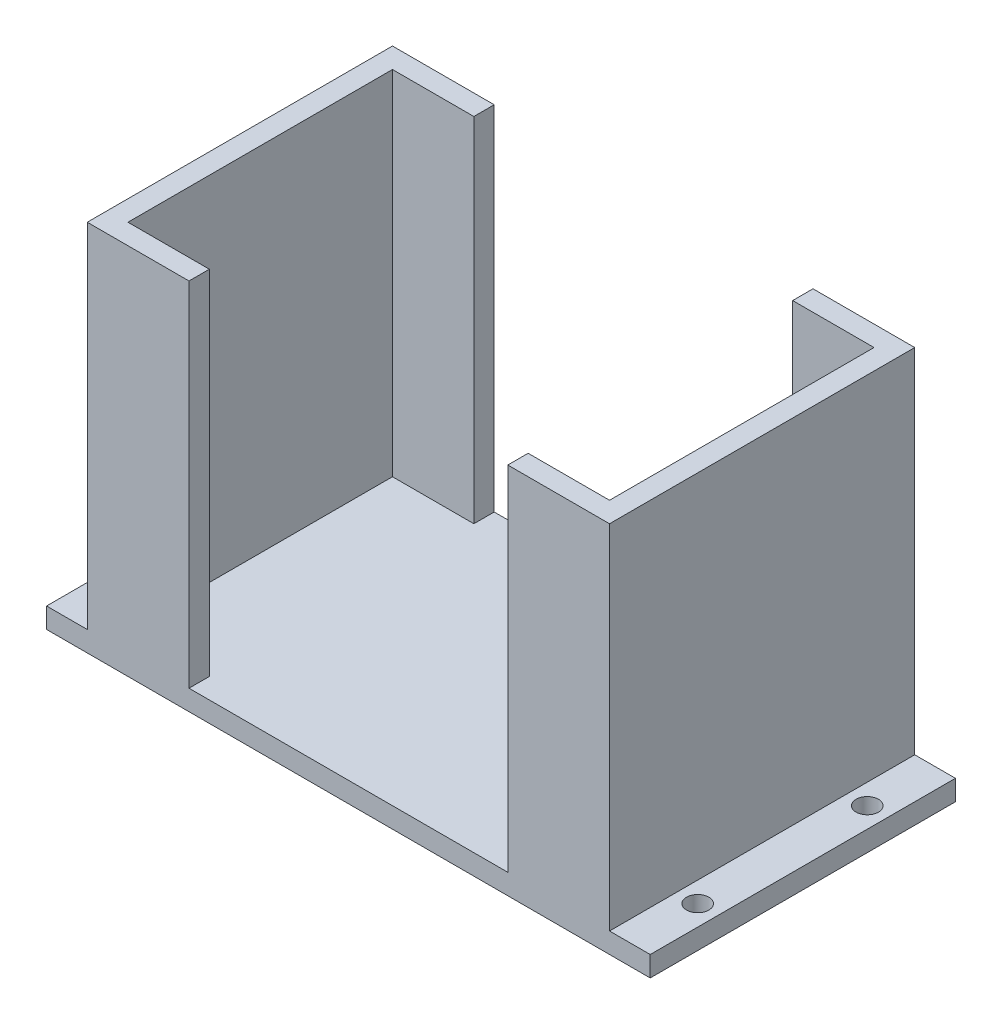
ISO-10303-21;
HEADER;
FILE_DESCRIPTION(('STEP AP214'),'2;1');
FILE_NAME('part.step','',(''),(''),'','','');
FILE_SCHEMA(('AUTOMOTIVE_DESIGN { 1 0 10303 214 1 1 1 1 }'));
ENDSEC;
DATA;
#1=APPLICATION_CONTEXT('core data for automotive mechanical design processes');
#2=APPLICATION_PROTOCOL_DEFINITION('international standard','automotive_design',2000,#1);
#3=PRODUCT_CONTEXT('',#1,'mechanical');
#4=PRODUCT('Part','Part','',(#3));
#5=PRODUCT_RELATED_PRODUCT_CATEGORY('part','',(#4));
#6=PRODUCT_DEFINITION_FORMATION('','',#4);
#7=PRODUCT_DEFINITION_CONTEXT('part definition',#1,'design');
#8=PRODUCT_DEFINITION('design','',#6,#7);
#9=PRODUCT_DEFINITION_SHAPE('','',#8);
#10=(LENGTH_UNIT() NAMED_UNIT(*) SI_UNIT(.MILLI.,.METRE.));
#11=(NAMED_UNIT(*) PLANE_ANGLE_UNIT() SI_UNIT($,.RADIAN.));
#12=(NAMED_UNIT(*) SI_UNIT($,.STERADIAN.) SOLID_ANGLE_UNIT());
#13=UNCERTAINTY_MEASURE_WITH_UNIT(LENGTH_MEASURE(1.E-05),#10,'distance_accuracy_value','');
#14=(GEOMETRIC_REPRESENTATION_CONTEXT(3) GLOBAL_UNCERTAINTY_ASSIGNED_CONTEXT((#13)) GLOBAL_UNIT_ASSIGNED_CONTEXT((#10,
#11,#12)) REPRESENTATION_CONTEXT('',''));
#15=CARTESIAN_POINT('',(0.,0.,0.));
#16=DIRECTION('',(0.,0.,1.));
#17=DIRECTION('',(1.,0.,0.));
#18=AXIS2_PLACEMENT_3D('',#15,#16,#17);
#19=CARTESIAN_POINT('',(-38.5,55.,0.));
#20=DIRECTION('',(1.,0.,0.));
#21=DIRECTION('',(0.,0.,-1.));
#22=AXIS2_PLACEMENT_3D('',#19,#20,#21);
#23=PLANE('',#22);
#24=DIRECTION('',(0.,0.,-1.));
#25=VECTOR('',#24,1.);
#26=CARTESIAN_POINT('',(-38.5,3.,-22.5));
#27=LINE('',#26,#25);
#28=CARTESIAN_POINT('',(-38.5,3.,22.5));
#29=VERTEX_POINT('',#28);
#30=CARTESIAN_POINT('',(-38.5,3.,-22.5));
#31=VERTEX_POINT('',#30);
#32=EDGE_CURVE('E50',#29,#31,#27,.T.);
#33=ORIENTED_EDGE('',*,*,#32,.F.);
#34=DIRECTION('',(0.,-1.,0.));
#35=VECTOR('',#34,1.);
#36=CARTESIAN_POINT('',(-38.5,55.,22.5));
#37=LINE('',#36,#35);
#38=CARTESIAN_POINT('',(-38.5,55.,22.5));
#39=VERTEX_POINT('',#38);
#40=EDGE_CURVE('E11',#39,#29,#37,.T.);
#41=ORIENTED_EDGE('',*,*,#40,.F.);
#42=DIRECTION('',(0.,0.,1.));
#43=VECTOR('',#42,1.);
#44=CARTESIAN_POINT('',(-38.5,55.,0.));
#45=LINE('',#44,#43);
#46=CARTESIAN_POINT('',(-38.5,55.,-22.5));
#47=VERTEX_POINT('',#46);
#48=EDGE_CURVE('E183',#47,#39,#45,.T.);
#49=ORIENTED_EDGE('',*,*,#48,.F.);
#50=DIRECTION('',(0.,-1.,0.));
#51=VECTOR('',#50,1.);
#52=CARTESIAN_POINT('',(-38.5,55.,-22.5));
#53=LINE('',#52,#51);
#54=EDGE_CURVE('E325',#47,#31,#53,.T.);
#55=ORIENTED_EDGE('',*,*,#54,.T.);
#56=EDGE_LOOP('',(#33,#41,#49,#55));
#57=FACE_BOUND('',#56,.T.);
#58=ADVANCED_FACE('F36',(#57),#23,.F.);
#59=CARTESIAN_POINT('',(-23.5,55.,0.));
#60=DIRECTION('',(-1.,0.,0.));
#61=DIRECTION('',(0.,0.,1.));
#62=AXIS2_PLACEMENT_3D('',#59,#60,#61);
#63=PLANE('',#62);
#64=DIRECTION('',(0.,0.,1.));
#65=VECTOR('',#64,1.);
#66=CARTESIAN_POINT('',(-23.5,3.,0.));
#67=LINE('',#66,#65);
#68=CARTESIAN_POINT('',(-23.5,3.,19.5));
#69=VERTEX_POINT('',#68);
#70=CARTESIAN_POINT('',(-23.5,3.,22.5));
#71=VERTEX_POINT('',#70);
#72=EDGE_CURVE('E277',#69,#71,#67,.T.);
#73=ORIENTED_EDGE('',*,*,#72,.F.);
#74=DIRECTION('',(0.,-1.,0.));
#75=VECTOR('',#74,1.);
#76=CARTESIAN_POINT('',(-23.5,55.,19.5));
#77=LINE('',#76,#75);
#78=CARTESIAN_POINT('',(-23.5,55.,19.5));
#79=VERTEX_POINT('',#78);
#80=EDGE_CURVE('E340',#79,#69,#77,.T.);
#81=ORIENTED_EDGE('',*,*,#80,.F.);
#82=DIRECTION('',(0.,0.,-1.));
#83=VECTOR('',#82,1.);
#84=CARTESIAN_POINT('',(-23.5,55.,0.));
#85=LINE('',#84,#83);
#86=CARTESIAN_POINT('',(-23.5,55.,22.5));
#87=VERTEX_POINT('',#86);
#88=EDGE_CURVE('E309',#87,#79,#85,.T.);
#89=ORIENTED_EDGE('',*,*,#88,.F.);
#90=DIRECTION('',(0.,-1.,0.));
#91=VECTOR('',#90,1.);
#92=CARTESIAN_POINT('',(-23.5,55.,22.5));
#93=LINE('',#92,#91);
#94=EDGE_CURVE('E43',#87,#71,#93,.T.);
#95=ORIENTED_EDGE('',*,*,#94,.T.);
#96=EDGE_LOOP('',(#73,#81,#89,#95));
#97=FACE_BOUND('',#96,.T.);
#98=ADVANCED_FACE('F347',(#97),#63,.F.);
#99=CARTESIAN_POINT('',(0.,55.,19.5));
#100=DIRECTION('',(0.,0.,-1.));
#101=DIRECTION('',(-1.,0.,0.));
#102=AXIS2_PLACEMENT_3D('',#99,#100,#101);
#103=PLANE('',#102);
#104=ORIENTED_EDGE('',*,*,#80,.T.);
#105=DIRECTION('',(1.,0.,0.));
#106=VECTOR('',#105,1.);
#107=CARTESIAN_POINT('',(0.,3.,19.5));
#108=LINE('',#107,#106);
#109=CARTESIAN_POINT('',(-35.5,3.,19.5));
#110=VERTEX_POINT('',#109);
#111=EDGE_CURVE('E280',#110,#69,#108,.T.);
#112=ORIENTED_EDGE('',*,*,#111,.F.);
#113=DIRECTION('',(0.,-1.,0.));
#114=VECTOR('',#113,1.);
#115=CARTESIAN_POINT('',(-35.5,55.,19.5));
#116=LINE('',#115,#114);
#117=CARTESIAN_POINT('',(-35.5,55.,19.5));
#118=VERTEX_POINT('',#117);
#119=EDGE_CURVE('E337',#118,#110,#116,.T.);
#120=ORIENTED_EDGE('',*,*,#119,.F.);
#121=DIRECTION('',(1.,0.,0.));
#122=VECTOR('',#121,1.);
#123=CARTESIAN_POINT('',(0.,55.,19.5));
#124=LINE('',#123,#122);
#125=EDGE_CURVE('E311',#118,#79,#124,.T.);
#126=ORIENTED_EDGE('',*,*,#125,.T.);
#127=EDGE_LOOP('',(#104,#112,#120,#126));
#128=FACE_BOUND('',#127,.T.);
#129=ADVANCED_FACE('F358',(#128),#103,.T.);
#130=CARTESIAN_POINT('',(-35.5,55.,0.));
#131=DIRECTION('',(1.,0.,0.));
#132=DIRECTION('',(0.,0.,-1.));
#133=AXIS2_PLACEMENT_3D('',#130,#131,#132);
#134=PLANE('',#133);
#135=ORIENTED_EDGE('',*,*,#119,.T.);
#136=DIRECTION('',(0.,0.,1.));
#137=VECTOR('',#136,1.);
#138=CARTESIAN_POINT('',(-35.5,3.,0.));
#139=LINE('',#138,#137);
#140=CARTESIAN_POINT('',(-35.5,3.,-19.5));
#141=VERTEX_POINT('',#140);
#142=EDGE_CURVE('E282',#141,#110,#139,.T.);
#143=ORIENTED_EDGE('',*,*,#142,.F.);
#144=DIRECTION('',(0.,-1.,0.));
#145=VECTOR('',#144,1.);
#146=CARTESIAN_POINT('',(-35.5,55.,-19.5));
#147=LINE('',#146,#145);
#148=CARTESIAN_POINT('',(-35.5,55.,-19.5));
#149=VERTEX_POINT('',#148);
#150=EDGE_CURVE('E334',#149,#141,#147,.T.);
#151=ORIENTED_EDGE('',*,*,#150,.F.);
#152=DIRECTION('',(0.,0.,1.));
#153=VECTOR('',#152,1.);
#154=CARTESIAN_POINT('',(-35.5,55.,0.));
#155=LINE('',#154,#153);
#156=EDGE_CURVE('E314',#149,#118,#155,.T.);
#157=ORIENTED_EDGE('',*,*,#156,.T.);
#158=EDGE_LOOP('',(#135,#143,#151,#157));
#159=FACE_BOUND('',#158,.T.);
#160=ADVANCED_FACE('F361',(#159),#134,.T.);
#161=CARTESIAN_POINT('',(0.,55.,-19.5));
#162=DIRECTION('',(0.,0.,-1.));
#163=DIRECTION('',(-1.,0.,0.));
#164=AXIS2_PLACEMENT_3D('',#161,#162,#163);
#165=PLANE('',#164);
#166=DIRECTION('',(1.,0.,0.));
#167=VECTOR('',#166,1.);
#168=CARTESIAN_POINT('',(0.,3.,-19.5));
#169=LINE('',#168,#167);
#170=CARTESIAN_POINT('',(-23.5,3.,-19.5));
#171=VERTEX_POINT('',#170);
#172=EDGE_CURVE('E285',#141,#171,#169,.T.);
#173=ORIENTED_EDGE('',*,*,#172,.T.);
#174=DIRECTION('',(0.,-1.,0.));
#175=VECTOR('',#174,1.);
#176=CARTESIAN_POINT('',(-23.5,55.,-19.5));
#177=LINE('',#176,#175);
#178=CARTESIAN_POINT('',(-23.5,55.,-19.5));
#179=VERTEX_POINT('',#178);
#180=EDGE_CURVE('E331',#179,#171,#177,.T.);
#181=ORIENTED_EDGE('',*,*,#180,.F.);
#182=DIRECTION('',(1.,0.,0.));
#183=VECTOR('',#182,1.);
#184=CARTESIAN_POINT('',(0.,55.,-19.5));
#185=LINE('',#184,#183);
#186=EDGE_CURVE('E317',#149,#179,#185,.T.);
#187=ORIENTED_EDGE('',*,*,#186,.F.);
#188=ORIENTED_EDGE('',*,*,#150,.T.);
#189=EDGE_LOOP('',(#173,#181,#187,#188));
#190=FACE_BOUND('',#189,.T.);
#191=ADVANCED_FACE('F377',(#190),#165,.F.);
#192=CARTESIAN_POINT('',(-23.5,55.,0.));
#193=DIRECTION('',(1.,0.,0.));
#194=DIRECTION('',(0.,0.,-1.));
#195=AXIS2_PLACEMENT_3D('',#192,#193,#194);
#196=PLANE('',#195);
#197=ORIENTED_EDGE('',*,*,#180,.T.);
#198=DIRECTION('',(0.,0.,1.));
#199=VECTOR('',#198,1.);
#200=CARTESIAN_POINT('',(-23.5,3.,0.));
#201=LINE('',#200,#199);
#202=CARTESIAN_POINT('',(-23.5,3.,-22.5));
#203=VERTEX_POINT('',#202);
#204=EDGE_CURVE('E288',#203,#171,#201,.T.);
#205=ORIENTED_EDGE('',*,*,#204,.F.);
#206=DIRECTION('',(0.,-1.,0.));
#207=VECTOR('',#206,1.);
#208=CARTESIAN_POINT('',(-23.5,55.,-22.5));
#209=LINE('',#208,#207);
#210=CARTESIAN_POINT('',(-23.5,55.,-22.5));
#211=VERTEX_POINT('',#210);
#212=EDGE_CURVE('E328',#211,#203,#209,.T.);
#213=ORIENTED_EDGE('',*,*,#212,.F.);
#214=DIRECTION('',(0.,0.,1.));
#215=VECTOR('',#214,1.);
#216=CARTESIAN_POINT('',(-23.5,55.,0.));
#217=LINE('',#216,#215);
#218=EDGE_CURVE('E319',#211,#179,#217,.T.);
#219=ORIENTED_EDGE('',*,*,#218,.T.);
#220=EDGE_LOOP('',(#197,#205,#213,#219));
#221=FACE_BOUND('',#220,.T.);
#222=ADVANCED_FACE('F375',(#221),#196,.T.);
#223=CARTESIAN_POINT('',(0.,55.,22.5));
#224=DIRECTION('',(0.,0.,-1.));
#225=DIRECTION('',(-1.,0.,0.));
#226=AXIS2_PLACEMENT_3D('',#223,#224,#225);
#227=PLANE('',#226);
#228=DIRECTION('',(1.,0.,0.));
#229=VECTOR('',#228,1.);
#230=CARTESIAN_POINT('',(0.,0.,22.5));
#231=LINE('',#230,#229);
#232=CARTESIAN_POINT('',(-44.5,0.,22.5));
#233=VERTEX_POINT('',#232);
#234=CARTESIAN_POINT('',(44.5,0.,22.5));
#235=VERTEX_POINT('',#234);
#236=EDGE_CURVE('E184',#233,#235,#231,.T.);
#237=ORIENTED_EDGE('',*,*,#236,.T.);
#238=DIRECTION('',(0.,-1.,0.));
#239=VECTOR('',#238,1.);
#240=CARTESIAN_POINT('',(44.5,0.,22.5));
#241=LINE('',#240,#239);
#242=CARTESIAN_POINT('',(44.5,3.,22.5));
#243=VERTEX_POINT('',#242);
#244=EDGE_CURVE('E222',#243,#235,#241,.T.);
#245=ORIENTED_EDGE('',*,*,#244,.F.);
#246=DIRECTION('',(-1.,0.,0.));
#247=VECTOR('',#246,1.);
#248=CARTESIAN_POINT('',(44.5,3.,22.5));
#249=LINE('',#248,#247);
#250=CARTESIAN_POINT('',(38.5,3.,22.5));
#251=VERTEX_POINT('',#250);
#252=EDGE_CURVE('E230',#243,#251,#249,.T.);
#253=ORIENTED_EDGE('',*,*,#252,.T.);
#254=DIRECTION('',(0.,-1.,0.));
#255=VECTOR('',#254,1.);
#256=CARTESIAN_POINT('',(38.5,55.,22.5));
#257=LINE('',#256,#255);
#258=CARTESIAN_POINT('',(38.5,55.,22.5));
#259=VERTEX_POINT('',#258);
#260=EDGE_CURVE('E272',#259,#251,#257,.T.);
#261=ORIENTED_EDGE('',*,*,#260,.F.);
#262=DIRECTION('',(1.,0.,0.));
#263=VECTOR('',#262,1.);
#264=CARTESIAN_POINT('',(0.,55.,22.5));
#265=LINE('',#264,#263);
#266=CARTESIAN_POINT('',(23.5,55.,22.5));
#267=VERTEX_POINT('',#266);
#268=EDGE_CURVE('E240',#267,#259,#265,.T.);
#269=ORIENTED_EDGE('',*,*,#268,.F.);
#270=DIRECTION('',(0.,-1.,0.));
#271=VECTOR('',#270,1.);
#272=CARTESIAN_POINT('',(23.5,55.,22.5));
#273=LINE('',#272,#271);
#274=CARTESIAN_POINT('',(23.5,3.,22.5));
#275=VERTEX_POINT('',#274);
#276=EDGE_CURVE('E274',#267,#275,#273,.T.);
#277=ORIENTED_EDGE('',*,*,#276,.T.);
#278=DIRECTION('',(1.,0.,0.));
#279=VECTOR('',#278,1.);
#280=CARTESIAN_POINT('',(0.,3.,22.5));
#281=LINE('',#280,#279);
#282=EDGE_CURVE('E302',#71,#275,#281,.T.);
#283=ORIENTED_EDGE('',*,*,#282,.F.);
#284=ORIENTED_EDGE('',*,*,#94,.F.);
#285=DIRECTION('',(1.,0.,0.));
#286=VECTOR('',#285,1.);
#287=CARTESIAN_POINT('',(0.,55.,22.5));
#288=LINE('',#287,#286);
#289=EDGE_CURVE('E307',#39,#87,#288,.T.);
#290=ORIENTED_EDGE('',*,*,#289,.F.);
#291=ORIENTED_EDGE('',*,*,#40,.T.);
#292=DIRECTION('',(1.,0.,0.));
#293=VECTOR('',#292,1.);
#294=CARTESIAN_POINT('',(-44.5,3.,22.5));
#295=LINE('',#294,#293);
#296=CARTESIAN_POINT('',(-44.5,3.,22.5));
#297=VERTEX_POINT('',#296);
#298=EDGE_CURVE('E207',#297,#29,#295,.T.);
#299=ORIENTED_EDGE('',*,*,#298,.F.);
#300=DIRECTION('',(0.,1.,0.));
#301=VECTOR('',#300,1.);
#302=CARTESIAN_POINT('',(-44.5,0.,22.5));
#303=LINE('',#302,#301);
#304=EDGE_CURVE('E191',#233,#297,#303,.T.);
#305=ORIENTED_EDGE('',*,*,#304,.F.);
#306=EDGE_LOOP('',(#237,#245,#253,#261,#269,#277,#283,#284,#290,#291,#299,#305));
#307=FACE_BOUND('',#306,.T.);
#308=ADVANCED_FACE('F350',(#307),#227,.F.);
#309=CARTESIAN_POINT('',(0.,55.,-22.5));
#310=DIRECTION('',(0.,0.,-1.));
#311=DIRECTION('',(-1.,0.,0.));
#312=AXIS2_PLACEMENT_3D('',#309,#310,#311);
#313=PLANE('',#312);
#314=DIRECTION('',(1.,0.,0.));
#315=VECTOR('',#314,1.);
#316=CARTESIAN_POINT('',(0.,0.,-22.5));
#317=LINE('',#316,#315);
#318=CARTESIAN_POINT('',(-44.5,0.,-22.5));
#319=VERTEX_POINT('',#318);
#320=CARTESIAN_POINT('',(44.5,0.,-22.5));
#321=VERTEX_POINT('',#320);
#322=EDGE_CURVE('E172',#319,#321,#317,.T.);
#323=ORIENTED_EDGE('',*,*,#322,.F.);
#324=DIRECTION('',(0.,-1.,0.));
#325=VECTOR('',#324,1.);
#326=CARTESIAN_POINT('',(-44.5,0.,-22.5));
#327=LINE('',#326,#325);
#328=CARTESIAN_POINT('',(-44.5,3.,-22.5));
#329=VERTEX_POINT('',#328);
#330=EDGE_CURVE('E177',#329,#319,#327,.T.);
#331=ORIENTED_EDGE('',*,*,#330,.F.);
#332=DIRECTION('',(1.,0.,0.));
#333=VECTOR('',#332,1.);
#334=CARTESIAN_POINT('',(-44.5,3.,-22.5));
#335=LINE('',#334,#333);
#336=EDGE_CURVE('E204',#329,#31,#335,.T.);
#337=ORIENTED_EDGE('',*,*,#336,.T.);
#338=ORIENTED_EDGE('',*,*,#54,.F.);
#339=DIRECTION('',(1.,0.,0.));
#340=VECTOR('',#339,1.);
#341=CARTESIAN_POINT('',(0.,55.,-22.5));
#342=LINE('',#341,#340);
#343=EDGE_CURVE('E322',#47,#211,#342,.T.);
#344=ORIENTED_EDGE('',*,*,#343,.T.);
#345=ORIENTED_EDGE('',*,*,#212,.T.);
#346=DIRECTION('',(1.,0.,0.));
#347=VECTOR('',#346,1.);
#348=CARTESIAN_POINT('',(0.,3.,-22.5));
#349=LINE('',#348,#347);
#350=CARTESIAN_POINT('',(23.5,3.,-22.5));
#351=VERTEX_POINT('',#350);
#352=EDGE_CURVE('E291',#203,#351,#349,.T.);
#353=ORIENTED_EDGE('',*,*,#352,.T.);
#354=DIRECTION('',(0.,-1.,0.));
#355=VECTOR('',#354,1.);
#356=CARTESIAN_POINT('',(23.5,55.,-22.5));
#357=LINE('',#356,#355);
#358=CARTESIAN_POINT('',(23.5,55.,-22.5));
#359=VERTEX_POINT('',#358);
#360=EDGE_CURVE('E268',#359,#351,#357,.T.);
#361=ORIENTED_EDGE('',*,*,#360,.F.);
#362=DIRECTION('',(1.,0.,0.));
#363=VECTOR('',#362,1.);
#364=CARTESIAN_POINT('',(0.,55.,-22.5));
#365=LINE('',#364,#363);
#366=CARTESIAN_POINT('',(38.5,55.,-22.5));
#367=VERTEX_POINT('',#366);
#368=EDGE_CURVE('E245',#359,#367,#365,.T.);
#369=ORIENTED_EDGE('',*,*,#368,.T.);
#370=DIRECTION('',(0.,-1.,0.));
#371=VECTOR('',#370,1.);
#372=CARTESIAN_POINT('',(38.5,55.,-22.5));
#373=LINE('',#372,#371);
#374=CARTESIAN_POINT('',(38.5,3.,-22.5));
#375=VERTEX_POINT('',#374);
#376=EDGE_CURVE('E270',#367,#375,#373,.T.);
#377=ORIENTED_EDGE('',*,*,#376,.T.);
#378=DIRECTION('',(-1.,0.,0.));
#379=VECTOR('',#378,1.);
#380=CARTESIAN_POINT('',(44.5,3.,-22.5));
#381=LINE('',#380,#379);
#382=CARTESIAN_POINT('',(44.5,3.,-22.5));
#383=VERTEX_POINT('',#382);
#384=EDGE_CURVE('E234',#383,#375,#381,.T.);
#385=ORIENTED_EDGE('',*,*,#384,.F.);
#386=DIRECTION('',(0.,1.,0.));
#387=VECTOR('',#386,1.);
#388=CARTESIAN_POINT('',(44.5,0.,-22.5));
#389=LINE('',#388,#387);
#390=EDGE_CURVE('E179',#321,#383,#389,.T.);
#391=ORIENTED_EDGE('',*,*,#390,.F.);
#392=EDGE_LOOP('',(#323,#331,#337,#338,#344,#345,#353,#361,#369,#377,#385,#391));
#393=FACE_BOUND('',#392,.T.);
#394=ADVANCED_FACE('F174',(#393),#313,.T.);
#395=CARTESIAN_POINT('',(0.,55.,0.));
#396=DIRECTION('',(0.,1.,0.));
#397=DIRECTION('',(0.,0.,1.));
#398=AXIS2_PLACEMENT_3D('',#395,#396,#397);
#399=PLANE('',#398);
#400=ORIENTED_EDGE('',*,*,#48,.T.);
#401=ORIENTED_EDGE('',*,*,#289,.T.);
#402=ORIENTED_EDGE('',*,*,#88,.T.);
#403=ORIENTED_EDGE('',*,*,#125,.F.);
#404=ORIENTED_EDGE('',*,*,#156,.F.);
#405=ORIENTED_EDGE('',*,*,#186,.T.);
#406=ORIENTED_EDGE('',*,*,#218,.F.);
#407=ORIENTED_EDGE('',*,*,#343,.F.);
#408=EDGE_LOOP('',(#400,#401,#402,#403,#404,#405,#406,#407));
#409=FACE_BOUND('',#408,.T.);
#410=ADVANCED_FACE('F365',(#409),#399,.T.);
#411=CARTESIAN_POINT('',(0.,0.,0.));
#412=DIRECTION('',(0.,1.,0.));
#413=DIRECTION('',(0.,0.,1.));
#414=AXIS2_PLACEMENT_3D('',#411,#412,#413);
#415=PLANE('',#414);
#416=CARTESIAN_POINT('',(-41.5,0.,-12.5));
#417=DIRECTION('',(0.,1.,0.));
#418=DIRECTION('',(0.,0.,1.));
#419=AXIS2_PLACEMENT_3D('',#416,#417,#418);
#420=CIRCLE('',#419,1.65);
#421=CARTESIAN_POINT('',(-41.5,0.,-10.85));
#422=VERTEX_POINT('',#421);
#423=EDGE_CURVE('E198',#422,#422,#420,.T.);
#424=ORIENTED_EDGE('',*,*,#423,.T.);
#425=EDGE_LOOP('',(#424));
#426=FACE_BOUND('',#425,.T.);
#427=CARTESIAN_POINT('',(-41.5,0.,12.5));
#428=DIRECTION('',(0.,1.,0.));
#429=DIRECTION('',(0.,0.,1.));
#430=AXIS2_PLACEMENT_3D('',#427,#428,#429);
#431=CIRCLE('',#430,1.65);
#432=CARTESIAN_POINT('',(-41.5,0.,14.15));
#433=VERTEX_POINT('',#432);
#434=EDGE_CURVE('E473',#433,#433,#431,.T.);
#435=ORIENTED_EDGE('',*,*,#434,.T.);
#436=EDGE_LOOP('',(#435));
#437=FACE_BOUND('',#436,.T.);
#438=CARTESIAN_POINT('',(41.5,0.,12.5));
#439=DIRECTION('',(0.,1.,0.));
#440=DIRECTION('',(0.,0.,1.));
#441=AXIS2_PLACEMENT_3D('',#438,#439,#440);
#442=CIRCLE('',#441,1.65);
#443=CARTESIAN_POINT('',(41.5,0.,14.15));
#444=VERTEX_POINT('',#443);
#445=EDGE_CURVE('E219',#444,#444,#442,.T.);
#446=ORIENTED_EDGE('',*,*,#445,.T.);
#447=EDGE_LOOP('',(#446));
#448=FACE_BOUND('',#447,.T.);
#449=CARTESIAN_POINT('',(41.5,0.,-12.5));
#450=DIRECTION('',(0.,1.,0.));
#451=DIRECTION('',(0.,0.,1.));
#452=AXIS2_PLACEMENT_3D('',#449,#450,#451);
#453=CIRCLE('',#452,1.65);
#454=CARTESIAN_POINT('',(41.5,0.,-10.85));
#455=VERTEX_POINT('',#454);
#456=EDGE_CURVE('E214',#455,#455,#453,.T.);
#457=ORIENTED_EDGE('',*,*,#456,.T.);
#458=EDGE_LOOP('',(#457));
#459=FACE_BOUND('',#458,.T.);
#460=ORIENTED_EDGE('',*,*,#322,.T.);
#461=DIRECTION('',(0.,0.,-1.));
#462=VECTOR('',#461,1.);
#463=CARTESIAN_POINT('',(44.5,0.,22.5));
#464=LINE('',#463,#462);
#465=EDGE_CURVE('E225',#235,#321,#464,.T.);
#466=ORIENTED_EDGE('',*,*,#465,.F.);
#467=ORIENTED_EDGE('',*,*,#236,.F.);
#468=DIRECTION('',(0.,0.,1.));
#469=VECTOR('',#468,1.);
#470=CARTESIAN_POINT('',(-44.5,0.,-22.5));
#471=LINE('',#470,#469);
#472=EDGE_CURVE('E187',#319,#233,#471,.T.);
#473=ORIENTED_EDGE('',*,*,#472,.F.);
#474=EDGE_LOOP('',(#460,#466,#467,#473));
#475=FACE_BOUND('',#474,.T.);
#476=ADVANCED_FACE('F188',(#426,#437,#448,#459,#475),#415,.F.);
#477=CARTESIAN_POINT('',(0.,3.,0.));
#478=DIRECTION('',(0.,-1.,0.));
#479=DIRECTION('',(0.,0.,-1.));
#480=AXIS2_PLACEMENT_3D('',#477,#478,#479);
#481=PLANE('',#480);
#482=ORIENTED_EDGE('',*,*,#72,.T.);
#483=ORIENTED_EDGE('',*,*,#282,.T.);
#484=DIRECTION('',(0.,0.,1.));
#485=VECTOR('',#484,1.);
#486=CARTESIAN_POINT('',(23.5,3.,0.));
#487=LINE('',#486,#485);
#488=CARTESIAN_POINT('',(23.5,3.,19.5));
#489=VERTEX_POINT('',#488);
#490=EDGE_CURVE('E300',#489,#275,#487,.T.);
#491=ORIENTED_EDGE('',*,*,#490,.F.);
#492=CARTESIAN_POINT('',(35.5,3.,19.5));
#493=VERTEX_POINT('',#492);
#494=EDGE_CURVE('E283',#489,#493,#108,.T.);
#495=ORIENTED_EDGE('',*,*,#494,.T.);
#496=DIRECTION('',(0.,0.,1.));
#497=VECTOR('',#496,1.);
#498=CARTESIAN_POINT('',(35.5,3.,0.));
#499=LINE('',#498,#497);
#500=CARTESIAN_POINT('',(35.5,3.,-19.5));
#501=VERTEX_POINT('',#500);
#502=EDGE_CURVE('E297',#501,#493,#499,.T.);
#503=ORIENTED_EDGE('',*,*,#502,.F.);
#504=CARTESIAN_POINT('',(23.5,3.,-19.5));
#505=VERTEX_POINT('',#504);
#506=EDGE_CURVE('E289',#505,#501,#169,.T.);
#507=ORIENTED_EDGE('',*,*,#506,.F.);
#508=DIRECTION('',(0.,0.,-1.));
#509=VECTOR('',#508,1.);
#510=CARTESIAN_POINT('',(23.5,3.,0.));
#511=LINE('',#510,#509);
#512=EDGE_CURVE('E294',#505,#351,#511,.T.);
#513=ORIENTED_EDGE('',*,*,#512,.T.);
#514=ORIENTED_EDGE('',*,*,#352,.F.);
#515=ORIENTED_EDGE('',*,*,#204,.T.);
#516=ORIENTED_EDGE('',*,*,#172,.F.);
#517=ORIENTED_EDGE('',*,*,#142,.T.);
#518=ORIENTED_EDGE('',*,*,#111,.T.);
#519=EDGE_LOOP('',(#482,#483,#491,#495,#503,#507,#513,#514,#515,#516,#517,#518));
#520=FACE_BOUND('',#519,.T.);
#521=ADVANCED_FACE('F354',(#520),#481,.F.);
#522=CARTESIAN_POINT('',(23.5,55.,0.));
#523=DIRECTION('',(-1.,0.,0.));
#524=DIRECTION('',(0.,0.,1.));
#525=AXIS2_PLACEMENT_3D('',#522,#523,#524);
#526=PLANE('',#525);
#527=ORIENTED_EDGE('',*,*,#490,.T.);
#528=ORIENTED_EDGE('',*,*,#276,.F.);
#529=DIRECTION('',(0.,0.,-1.));
#530=VECTOR('',#529,1.);
#531=CARTESIAN_POINT('',(23.5,55.,0.));
#532=LINE('',#531,#530);
#533=CARTESIAN_POINT('',(23.5,55.,19.5));
#534=VERTEX_POINT('',#533);
#535=EDGE_CURVE('E237',#267,#534,#532,.T.);
#536=ORIENTED_EDGE('',*,*,#535,.T.);
#537=DIRECTION('',(0.,-1.,0.));
#538=VECTOR('',#537,1.);
#539=CARTESIAN_POINT('',(23.5,55.,19.5));
#540=LINE('',#539,#538);
#541=EDGE_CURVE('E257',#534,#489,#540,.T.);
#542=ORIENTED_EDGE('',*,*,#541,.T.);
#543=EDGE_LOOP('',(#527,#528,#536,#542));
#544=FACE_BOUND('',#543,.T.);
#545=ADVANCED_FACE('F410',(#544),#526,.T.);
#546=CARTESIAN_POINT('',(23.5,55.,0.));
#547=DIRECTION('',(1.,0.,0.));
#548=DIRECTION('',(0.,0.,-1.));
#549=AXIS2_PLACEMENT_3D('',#546,#547,#548);
#550=PLANE('',#549);
#551=ORIENTED_EDGE('',*,*,#360,.T.);
#552=ORIENTED_EDGE('',*,*,#512,.F.);
#553=DIRECTION('',(0.,-1.,0.));
#554=VECTOR('',#553,1.);
#555=CARTESIAN_POINT('',(23.5,55.,-19.5));
#556=LINE('',#555,#554);
#557=CARTESIAN_POINT('',(23.5,55.,-19.5));
#558=VERTEX_POINT('',#557);
#559=EDGE_CURVE('E265',#558,#505,#556,.T.);
#560=ORIENTED_EDGE('',*,*,#559,.F.);
#561=DIRECTION('',(0.,0.,1.));
#562=VECTOR('',#561,1.);
#563=CARTESIAN_POINT('',(23.5,55.,0.));
#564=LINE('',#563,#562);
#565=EDGE_CURVE('E248',#359,#558,#564,.T.);
#566=ORIENTED_EDGE('',*,*,#565,.F.);
#567=EDGE_LOOP('',(#551,#552,#560,#566));
#568=FACE_BOUND('',#567,.T.);
#569=ADVANCED_FACE('F413',(#568),#550,.F.);
#570=CARTESIAN_POINT('',(0.,55.,-19.5));
#571=DIRECTION('',(0.,0.,-1.));
#572=DIRECTION('',(-1.,0.,0.));
#573=AXIS2_PLACEMENT_3D('',#570,#571,#572);
#574=PLANE('',#573);
#575=ORIENTED_EDGE('',*,*,#559,.T.);
#576=ORIENTED_EDGE('',*,*,#506,.T.);
#577=DIRECTION('',(0.,-1.,0.));
#578=VECTOR('',#577,1.);
#579=CARTESIAN_POINT('',(35.5,55.,-19.5));
#580=LINE('',#579,#578);
#581=CARTESIAN_POINT('',(35.5,55.,-19.5));
#582=VERTEX_POINT('',#581);
#583=EDGE_CURVE('E262',#582,#501,#580,.T.);
#584=ORIENTED_EDGE('',*,*,#583,.F.);
#585=DIRECTION('',(1.,0.,0.));
#586=VECTOR('',#585,1.);
#587=CARTESIAN_POINT('',(0.,55.,-19.5));
#588=LINE('',#587,#586);
#589=EDGE_CURVE('E250',#558,#582,#588,.T.);
#590=ORIENTED_EDGE('',*,*,#589,.F.);
#591=EDGE_LOOP('',(#575,#576,#584,#590));
#592=FACE_BOUND('',#591,.T.);
#593=ADVANCED_FACE('F422',(#592),#574,.F.);
#594=CARTESIAN_POINT('',(35.5,55.,0.));
#595=DIRECTION('',(1.,0.,0.));
#596=DIRECTION('',(0.,0.,-1.));
#597=AXIS2_PLACEMENT_3D('',#594,#595,#596);
#598=PLANE('',#597);
#599=ORIENTED_EDGE('',*,*,#583,.T.);
#600=ORIENTED_EDGE('',*,*,#502,.T.);
#601=DIRECTION('',(0.,-1.,0.));
#602=VECTOR('',#601,1.);
#603=CARTESIAN_POINT('',(35.5,55.,19.5));
#604=LINE('',#603,#602);
#605=CARTESIAN_POINT('',(35.5,55.,19.5));
#606=VERTEX_POINT('',#605);
#607=EDGE_CURVE('E260',#606,#493,#604,.T.);
#608=ORIENTED_EDGE('',*,*,#607,.F.);
#609=DIRECTION('',(0.,0.,1.));
#610=VECTOR('',#609,1.);
#611=CARTESIAN_POINT('',(35.5,55.,0.));
#612=LINE('',#611,#610);
#613=EDGE_CURVE('E252',#582,#606,#612,.T.);
#614=ORIENTED_EDGE('',*,*,#613,.F.);
#615=EDGE_LOOP('',(#599,#600,#608,#614));
#616=FACE_BOUND('',#615,.T.);
#617=ADVANCED_FACE('F426',(#616),#598,.F.);
#618=CARTESIAN_POINT('',(0.,55.,19.5));
#619=DIRECTION('',(0.,0.,-1.));
#620=DIRECTION('',(-1.,0.,0.));
#621=AXIS2_PLACEMENT_3D('',#618,#619,#620);
#622=PLANE('',#621);
#623=ORIENTED_EDGE('',*,*,#494,.F.);
#624=ORIENTED_EDGE('',*,*,#541,.F.);
#625=DIRECTION('',(1.,0.,0.));
#626=VECTOR('',#625,1.);
#627=CARTESIAN_POINT('',(0.,55.,19.5));
#628=LINE('',#627,#626);
#629=EDGE_CURVE('E254',#534,#606,#628,.T.);
#630=ORIENTED_EDGE('',*,*,#629,.T.);
#631=ORIENTED_EDGE('',*,*,#607,.T.);
#632=EDGE_LOOP('',(#623,#624,#630,#631));
#633=FACE_BOUND('',#632,.T.);
#634=ADVANCED_FACE('F419',(#633),#622,.T.);
#635=CARTESIAN_POINT('',(38.5,55.,0.));
#636=DIRECTION('',(1.,0.,0.));
#637=DIRECTION('',(0.,0.,-1.));
#638=AXIS2_PLACEMENT_3D('',#635,#636,#637);
#639=PLANE('',#638);
#640=DIRECTION('',(0.,0.,1.));
#641=VECTOR('',#640,1.);
#642=CARTESIAN_POINT('',(38.5,3.,22.5));
#643=LINE('',#642,#641);
#644=EDGE_CURVE('E57',#375,#251,#643,.T.);
#645=ORIENTED_EDGE('',*,*,#644,.F.);
#646=ORIENTED_EDGE('',*,*,#376,.F.);
#647=DIRECTION('',(0.,0.,1.));
#648=VECTOR('',#647,1.);
#649=CARTESIAN_POINT('',(38.5,55.,0.));
#650=LINE('',#649,#648);
#651=EDGE_CURVE('E242',#367,#259,#650,.T.);
#652=ORIENTED_EDGE('',*,*,#651,.T.);
#653=ORIENTED_EDGE('',*,*,#260,.T.);
#654=EDGE_LOOP('',(#645,#646,#652,#653));
#655=FACE_BOUND('',#654,.T.);
#656=ADVANCED_FACE('F415',(#655),#639,.T.);
#657=CARTESIAN_POINT('',(0.,55.,0.));
#658=DIRECTION('',(0.,1.,0.));
#659=DIRECTION('',(0.,0.,1.));
#660=AXIS2_PLACEMENT_3D('',#657,#658,#659);
#661=PLANE('',#660);
#662=ORIENTED_EDGE('',*,*,#535,.F.);
#663=ORIENTED_EDGE('',*,*,#268,.T.);
#664=ORIENTED_EDGE('',*,*,#651,.F.);
#665=ORIENTED_EDGE('',*,*,#368,.F.);
#666=ORIENTED_EDGE('',*,*,#565,.T.);
#667=ORIENTED_EDGE('',*,*,#589,.T.);
#668=ORIENTED_EDGE('',*,*,#613,.T.);
#669=ORIENTED_EDGE('',*,*,#629,.F.);
#670=EDGE_LOOP('',(#662,#663,#664,#665,#666,#667,#668,#669));
#671=FACE_BOUND('',#670,.T.);
#672=ADVANCED_FACE('F418',(#671),#661,.T.);
#673=CARTESIAN_POINT('',(44.5,3.,22.5));
#674=DIRECTION('',(0.,-1.,0.));
#675=DIRECTION('',(0.,0.,-1.));
#676=AXIS2_PLACEMENT_3D('',#673,#674,#675);
#677=PLANE('',#676);
#678=CARTESIAN_POINT('',(41.5,3.,12.5));
#679=DIRECTION('',(0.,1.,0.));
#680=DIRECTION('',(0.,0.,1.));
#681=AXIS2_PLACEMENT_3D('',#678,#679,#680);
#682=CIRCLE('',#681,1.65);
#683=CARTESIAN_POINT('',(41.5,3.,14.15));
#684=VERTEX_POINT('',#683);
#685=EDGE_CURVE('E211',#684,#684,#682,.T.);
#686=ORIENTED_EDGE('',*,*,#685,.F.);
#687=EDGE_LOOP('',(#686));
#688=FACE_BOUND('',#687,.T.);
#689=CARTESIAN_POINT('',(41.5,3.,-12.5));
#690=DIRECTION('',(0.,1.,0.));
#691=DIRECTION('',(0.,0.,1.));
#692=AXIS2_PLACEMENT_3D('',#689,#690,#691);
#693=CIRCLE('',#692,1.65);
#694=CARTESIAN_POINT('',(41.5,3.,-10.85));
#695=VERTEX_POINT('',#694);
#696=EDGE_CURVE('E210',#695,#695,#693,.T.);
#697=ORIENTED_EDGE('',*,*,#696,.F.);
#698=EDGE_LOOP('',(#697));
#699=FACE_BOUND('',#698,.T.);
#700=ORIENTED_EDGE('',*,*,#644,.T.);
#701=ORIENTED_EDGE('',*,*,#252,.F.);
#702=DIRECTION('',(0.,0.,1.));
#703=VECTOR('',#702,1.);
#704=CARTESIAN_POINT('',(44.5,3.,22.5));
#705=LINE('',#704,#703);
#706=EDGE_CURVE('E228',#383,#243,#705,.T.);
#707=ORIENTED_EDGE('',*,*,#706,.F.);
#708=ORIENTED_EDGE('',*,*,#384,.T.);
#709=EDGE_LOOP('',(#700,#701,#707,#708));
#710=FACE_BOUND('',#709,.T.);
#711=ADVANCED_FACE('F436',(#688,#699,#710),#677,.F.);
#712=CARTESIAN_POINT('',(44.5,0.,0.));
#713=DIRECTION('',(-1.,0.,0.));
#714=DIRECTION('',(0.,0.,1.));
#715=AXIS2_PLACEMENT_3D('',#712,#713,#714);
#716=PLANE('',#715);
#717=ORIENTED_EDGE('',*,*,#244,.T.);
#718=ORIENTED_EDGE('',*,*,#465,.T.);
#719=ORIENTED_EDGE('',*,*,#390,.T.);
#720=ORIENTED_EDGE('',*,*,#706,.T.);
#721=EDGE_LOOP('',(#717,#718,#719,#720));
#722=FACE_BOUND('',#721,.T.);
#723=ADVANCED_FACE('F440',(#722),#716,.F.);
#724=CARTESIAN_POINT('',(41.5,-3.,-12.5));
#725=DIRECTION('',(0.,1.,0.));
#726=DIRECTION('',(0.,0.,1.));
#727=AXIS2_PLACEMENT_3D('',#724,#725,#726);
#728=CYLINDRICAL_SURFACE('',#727,1.65);
#729=ORIENTED_EDGE('',*,*,#696,.T.);
#730=EDGE_LOOP('',(#729));
#731=FACE_BOUND('',#730,.T.);
#732=ORIENTED_EDGE('',*,*,#456,.F.);
#733=EDGE_LOOP('',(#732));
#734=FACE_BOUND('',#733,.T.);
#735=ADVANCED_FACE('F444',(#731,#734),#728,.F.);
#736=CARTESIAN_POINT('',(41.5,-3.,12.5));
#737=DIRECTION('',(0.,1.,0.));
#738=DIRECTION('',(0.,0.,1.));
#739=AXIS2_PLACEMENT_3D('',#736,#737,#738);
#740=CYLINDRICAL_SURFACE('',#739,1.65);
#741=ORIENTED_EDGE('',*,*,#685,.T.);
#742=EDGE_LOOP('',(#741));
#743=FACE_BOUND('',#742,.T.);
#744=ORIENTED_EDGE('',*,*,#445,.F.);
#745=EDGE_LOOP('',(#744));
#746=FACE_BOUND('',#745,.T.);
#747=ADVANCED_FACE('F448',(#743,#746),#740,.F.);
#748=CARTESIAN_POINT('',(-44.5,3.,-22.5));
#749=DIRECTION('',(0.,-1.,0.));
#750=DIRECTION('',(0.,0.,-1.));
#751=AXIS2_PLACEMENT_3D('',#748,#749,#750);
#752=PLANE('',#751);
#753=CARTESIAN_POINT('',(-41.5,3.,-12.5));
#754=DIRECTION('',(0.,1.,0.));
#755=DIRECTION('',(0.,0.,1.));
#756=AXIS2_PLACEMENT_3D('',#753,#754,#755);
#757=CIRCLE('',#756,1.65);
#758=CARTESIAN_POINT('',(-41.5,3.,-10.85));
#759=VERTEX_POINT('',#758);
#760=EDGE_CURVE('E470',#759,#759,#757,.T.);
#761=ORIENTED_EDGE('',*,*,#760,.F.);
#762=EDGE_LOOP('',(#761));
#763=FACE_BOUND('',#762,.T.);
#764=CARTESIAN_POINT('',(-41.5,3.,12.5));
#765=DIRECTION('',(0.,1.,0.));
#766=DIRECTION('',(0.,0.,1.));
#767=AXIS2_PLACEMENT_3D('',#764,#765,#766);
#768=CIRCLE('',#767,1.65);
#769=CARTESIAN_POINT('',(-41.5,3.,14.15));
#770=VERTEX_POINT('',#769);
#771=EDGE_CURVE('E477',#770,#770,#768,.T.);
#772=ORIENTED_EDGE('',*,*,#771,.F.);
#773=EDGE_LOOP('',(#772));
#774=FACE_BOUND('',#773,.T.);
#775=ORIENTED_EDGE('',*,*,#32,.T.);
#776=ORIENTED_EDGE('',*,*,#336,.F.);
#777=DIRECTION('',(0.,0.,-1.));
#778=VECTOR('',#777,1.);
#779=CARTESIAN_POINT('',(-44.5,3.,-22.5));
#780=LINE('',#779,#778);
#781=EDGE_CURVE('E195',#297,#329,#780,.T.);
#782=ORIENTED_EDGE('',*,*,#781,.F.);
#783=ORIENTED_EDGE('',*,*,#298,.T.);
#784=EDGE_LOOP('',(#775,#776,#782,#783));
#785=FACE_BOUND('',#784,.T.);
#786=ADVANCED_FACE('F372',(#763,#774,#785),#752,.F.);
#787=CARTESIAN_POINT('',(-44.5,0.,0.));
#788=DIRECTION('',(1.,0.,0.));
#789=DIRECTION('',(0.,0.,-1.));
#790=AXIS2_PLACEMENT_3D('',#787,#788,#789);
#791=PLANE('',#790);
#792=ORIENTED_EDGE('',*,*,#330,.T.);
#793=ORIENTED_EDGE('',*,*,#472,.T.);
#794=ORIENTED_EDGE('',*,*,#304,.T.);
#795=ORIENTED_EDGE('',*,*,#781,.T.);
#796=EDGE_LOOP('',(#792,#793,#794,#795));
#797=FACE_BOUND('',#796,.T.);
#798=ADVANCED_FACE('F193',(#797),#791,.F.);
#799=CARTESIAN_POINT('',(-41.5,-3.,12.5));
#800=DIRECTION('',(0.,1.,0.));
#801=DIRECTION('',(0.,0.,1.));
#802=AXIS2_PLACEMENT_3D('',#799,#800,#801);
#803=CYLINDRICAL_SURFACE('',#802,1.65);
#804=ORIENTED_EDGE('',*,*,#771,.T.);
#805=EDGE_LOOP('',(#804));
#806=FACE_BOUND('',#805,.T.);
#807=ORIENTED_EDGE('',*,*,#434,.F.);
#808=EDGE_LOOP('',(#807));
#809=FACE_BOUND('',#808,.T.);
#810=ADVANCED_FACE('F458',(#806,#809),#803,.F.);
#811=CARTESIAN_POINT('',(-41.5,-3.,-12.5));
#812=DIRECTION('',(0.,1.,0.));
#813=DIRECTION('',(0.,0.,1.));
#814=AXIS2_PLACEMENT_3D('',#811,#812,#813);
#815=CYLINDRICAL_SURFACE('',#814,1.65);
#816=ORIENTED_EDGE('',*,*,#760,.T.);
#817=EDGE_LOOP('',(#816));
#818=FACE_BOUND('',#817,.T.);
#819=ORIENTED_EDGE('',*,*,#423,.F.);
#820=EDGE_LOOP('',(#819));
#821=FACE_BOUND('',#820,.T.);
#822=ADVANCED_FACE('F461',(#818,#821),#815,.F.);
#823=CLOSED_SHELL('',(#58,#98,#129,#160,#191,#222,#308,#394,#410,#476,#521,#545,#569,#593,#617,
#634,#656,#672,#711,#723,#735,#747,#786,#798,#810,#822));
#824=MANIFOLD_SOLID_BREP('B2',#823);
#825=ADVANCED_BREP_SHAPE_REPRESENTATION('',(#18,#824),#14);
#826=SHAPE_DEFINITION_REPRESENTATION(#9,#825);
ENDSEC;
END-ISO-10303-21;
